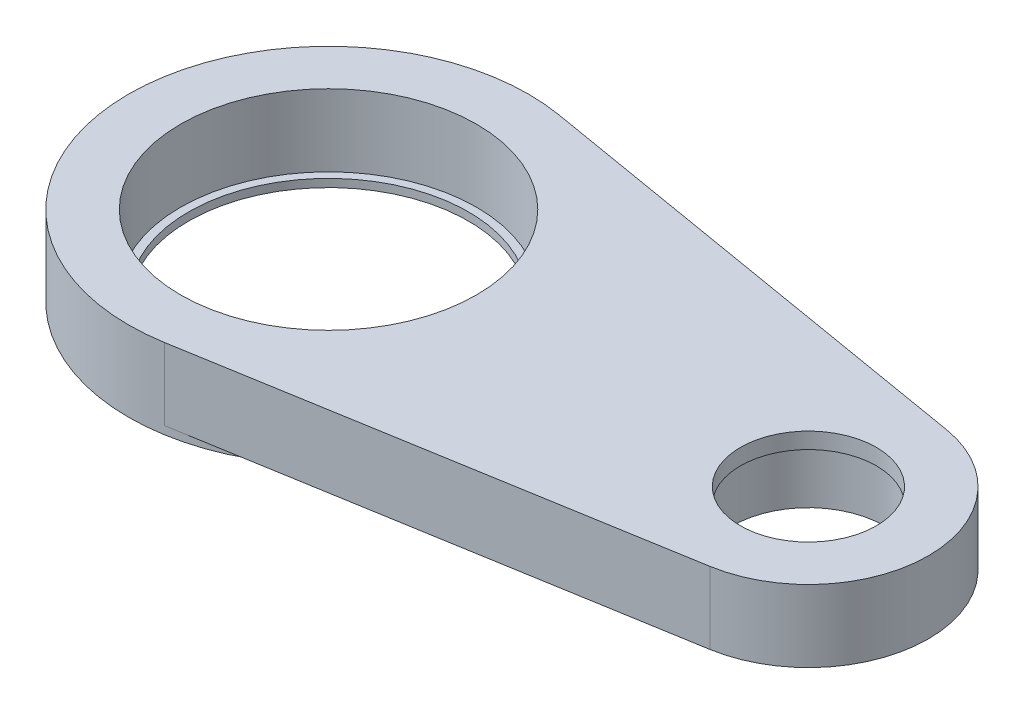
ISO-10303-21;
HEADER;
FILE_DESCRIPTION(('STEP AP214'),'2;1');
FILE_NAME('part.step','',(''),(''),'','','');
FILE_SCHEMA(('AUTOMOTIVE_DESIGN { 1 0 10303 214 1 1 1 1 }'));
ENDSEC;
DATA;
#1=APPLICATION_CONTEXT('core data for automotive mechanical design processes');
#2=APPLICATION_PROTOCOL_DEFINITION('international standard','automotive_design',2000,#1);
#3=PRODUCT_CONTEXT('',#1,'mechanical');
#4=PRODUCT('Part','Part','',(#3));
#5=PRODUCT_RELATED_PRODUCT_CATEGORY('part','',(#4));
#6=PRODUCT_DEFINITION_FORMATION('','',#4);
#7=PRODUCT_DEFINITION_CONTEXT('part definition',#1,'design');
#8=PRODUCT_DEFINITION('design','',#6,#7);
#9=PRODUCT_DEFINITION_SHAPE('','',#8);
#10=(LENGTH_UNIT() NAMED_UNIT(*) SI_UNIT(.MILLI.,.METRE.));
#11=(NAMED_UNIT(*) PLANE_ANGLE_UNIT() SI_UNIT($,.RADIAN.));
#12=(NAMED_UNIT(*) SI_UNIT($,.STERADIAN.) SOLID_ANGLE_UNIT());
#13=UNCERTAINTY_MEASURE_WITH_UNIT(LENGTH_MEASURE(1.E-05),#10,'distance_accuracy_value','');
#14=(GEOMETRIC_REPRESENTATION_CONTEXT(3) GLOBAL_UNCERTAINTY_ASSIGNED_CONTEXT((#13)) GLOBAL_UNIT_ASSIGNED_CONTEXT((#10,
#11,#12)) REPRESENTATION_CONTEXT('',''));
#15=CARTESIAN_POINT('',(0.,0.,0.));
#16=DIRECTION('',(0.,0.,1.));
#17=DIRECTION('',(1.,0.,0.));
#18=AXIS2_PLACEMENT_3D('',#15,#16,#17);
#19=CARTESIAN_POINT('',(0.,5.,0.));
#20=DIRECTION('',(0.,-1.,0.));
#21=DIRECTION('',(0.,0.,-1.));
#22=AXIS2_PLACEMENT_3D('',#19,#20,#21);
#23=CYLINDRICAL_SURFACE('',#22,17.5);
#24=CARTESIAN_POINT('',(0.,0.,0.));
#25=DIRECTION('',(0.,1.,0.));
#26=DIRECTION('',(0.,0.,1.));
#27=AXIS2_PLACEMENT_3D('',#24,#25,#26);
#28=CIRCLE('',#27,17.5);
#29=CARTESIAN_POINT('',(0.,0.,17.5));
#30=VERTEX_POINT('',#29);
#31=EDGE_CURVE('E48',#30,#30,#28,.T.);
#32=ORIENTED_EDGE('',*,*,#31,.F.);
#33=EDGE_LOOP('',(#32));
#34=FACE_BOUND('',#33,.T.);
#35=CARTESIAN_POINT('',(0.,1.,0.));
#36=DIRECTION('',(0.,1.,0.));
#37=DIRECTION('',(0.,0.,1.));
#38=AXIS2_PLACEMENT_3D('',#35,#36,#37);
#39=CIRCLE('',#38,17.5);
#40=CARTESIAN_POINT('',(0.,1.,17.5));
#41=VERTEX_POINT('',#40);
#42=EDGE_CURVE('E43',#41,#41,#39,.T.);
#43=ORIENTED_EDGE('',*,*,#42,.T.);
#44=EDGE_LOOP('',(#43));
#45=FACE_BOUND('',#44,.T.);
#46=ADVANCED_FACE('F39',(#34,#45),#23,.F.);
#47=CARTESIAN_POINT('',(0.,5.,0.));
#48=DIRECTION('',(0.,-1.,0.));
#49=DIRECTION('',(0.,0.,-1.));
#50=AXIS2_PLACEMENT_3D('',#47,#48,#49);
#51=CYLINDRICAL_SURFACE('',#50,25.);
#52=CARTESIAN_POINT('',(0.,0.,0.));
#53=DIRECTION('',(0.,1.,0.));
#54=DIRECTION('',(0.,0.,1.));
#55=AXIS2_PLACEMENT_3D('',#52,#53,#54);
#56=CIRCLE('',#55,25.);
#57=CARTESIAN_POINT('',(0.,0.,25.));
#58=VERTEX_POINT('',#57);
#59=EDGE_CURVE('E12',#58,#58,#56,.T.);
#60=ORIENTED_EDGE('',*,*,#59,.T.);
#61=EDGE_LOOP('',(#60));
#62=FACE_BOUND('',#61,.T.);
#63=DIRECTION('',(0.,1.,0.));
#64=VECTOR('',#63,1.);
#65=CARTESIAN_POINT('',(4.16666666666667,1.,24.6503324295817));
#66=LINE('',#65,#64);
#67=CARTESIAN_POINT('',(4.16666666666667,1.,24.6503324295817));
#68=VERTEX_POINT('',#67);
#69=CARTESIAN_POINT('',(4.16666666666667,10.,24.6503324295817));
#70=VERTEX_POINT('',#69);
#71=EDGE_CURVE('E104',#68,#70,#66,.T.);
#72=ORIENTED_EDGE('',*,*,#71,.T.);
#73=CARTESIAN_POINT('',(0.,10.,0.));
#74=DIRECTION('',(0.,1.,0.));
#75=DIRECTION('',(0.,0.,1.));
#76=AXIS2_PLACEMENT_3D('',#73,#74,#75);
#77=CIRCLE('',#76,25.);
#78=CARTESIAN_POINT('',(4.16666666666667,10.,-24.6503324295817));
#79=VERTEX_POINT('',#78);
#80=EDGE_CURVE('E103',#79,#70,#77,.T.);
#81=ORIENTED_EDGE('',*,*,#80,.F.);
#82=DIRECTION('',(0.,1.,0.));
#83=VECTOR('',#82,1.);
#84=CARTESIAN_POINT('',(4.16666666666667,1.,-24.6503324295817));
#85=LINE('',#84,#83);
#86=CARTESIAN_POINT('',(4.16666666666667,1.,-24.6503324295817));
#87=VERTEX_POINT('',#86);
#88=EDGE_CURVE('E99',#87,#79,#85,.T.);
#89=ORIENTED_EDGE('',*,*,#88,.F.);
#90=CARTESIAN_POINT('',(0.,1.,0.));
#91=DIRECTION('',(0.,-1.,0.));
#92=DIRECTION('',(0.,0.,1.));
#93=AXIS2_PLACEMENT_3D('',#90,#91,#92);
#94=CIRCLE('',#93,25.);
#95=EDGE_CURVE('E90',#87,#68,#94,.T.);
#96=ORIENTED_EDGE('',*,*,#95,.T.);
#97=EDGE_LOOP('',(#72,#81,#89,#96));
#98=FACE_BOUND('',#97,.T.);
#99=ADVANCED_FACE('F41',(#62,#98),#51,.T.);
#100=CARTESIAN_POINT('',(0.,0.,0.));
#101=DIRECTION('',(0.,1.,0.));
#102=DIRECTION('',(0.,0.,1.));
#103=AXIS2_PLACEMENT_3D('',#100,#101,#102);
#104=PLANE('',#103);
#105=ORIENTED_EDGE('',*,*,#59,.F.);
#106=EDGE_LOOP('',(#105));
#107=FACE_BOUND('',#106,.T.);
#108=ORIENTED_EDGE('',*,*,#31,.T.);
#109=EDGE_LOOP('',(#108));
#110=FACE_BOUND('',#109,.T.);
#111=ADVANCED_FACE('F117',(#107,#110),#104,.F.);
#112=CARTESIAN_POINT('',(0.,10.,0.));
#113=DIRECTION('',(0.,1.,0.));
#114=DIRECTION('',(0.,0.,1.));
#115=AXIS2_PLACEMENT_3D('',#112,#113,#114);
#116=PLANE('',#115);
#117=CARTESIAN_POINT('',(60.,10.,0.));
#118=DIRECTION('',(0.,-1.,0.));
#119=DIRECTION('',(0.,0.,-1.));
#120=AXIS2_PLACEMENT_3D('',#117,#118,#119);
#121=CIRCLE('',#120,8.50000000000001);
#122=CARTESIAN_POINT('',(60.,10.,-8.50000000000001));
#123=VERTEX_POINT('',#122);
#124=EDGE_CURVE('E249',#123,#123,#121,.T.);
#125=ORIENTED_EDGE('',*,*,#124,.T.);
#126=EDGE_LOOP('',(#125));
#127=FACE_BOUND('',#126,.T.);
#128=ORIENTED_EDGE('',*,*,#80,.T.);
#129=DIRECTION('',(0.986013297183269,0.,-0.166666666666667));
#130=VECTOR('',#129,1.);
#131=CARTESIAN_POINT('',(4.16666666666667,10.,24.6503324295817));
#132=LINE('',#131,#130);
#133=CARTESIAN_POINT('',(62.5,10.,14.790199457749));
#134=VERTEX_POINT('',#133);
#135=EDGE_CURVE('E138',#70,#134,#132,.T.);
#136=ORIENTED_EDGE('',*,*,#135,.T.);
#137=CARTESIAN_POINT('',(60.,10.,0.));
#138=DIRECTION('',(0.,1.,0.));
#139=DIRECTION('',(0.,0.,1.));
#140=AXIS2_PLACEMENT_3D('',#137,#138,#139);
#141=CIRCLE('',#140,15.);
#142=CARTESIAN_POINT('',(62.5,10.,-14.790199457749));
#143=VERTEX_POINT('',#142);
#144=EDGE_CURVE('E125',#134,#143,#141,.T.);
#145=ORIENTED_EDGE('',*,*,#144,.T.);
#146=DIRECTION('',(-0.986013297183269,0.,-0.166666666666667));
#147=VECTOR('',#146,1.);
#148=CARTESIAN_POINT('',(4.16666666666667,10.,-24.6503324295817));
#149=LINE('',#148,#147);
#150=EDGE_CURVE('E55',#143,#79,#149,.T.);
#151=ORIENTED_EDGE('',*,*,#150,.T.);
#152=EDGE_LOOP('',(#128,#136,#145,#151));
#153=FACE_BOUND('',#152,.T.);
#154=CARTESIAN_POINT('',(0.,10.,0.));
#155=DIRECTION('',(0.,1.,0.));
#156=DIRECTION('',(0.,0.,1.));
#157=AXIS2_PLACEMENT_3D('',#154,#155,#156);
#158=CIRCLE('',#157,18.5);
#159=CARTESIAN_POINT('',(0.,10.,18.5));
#160=VERTEX_POINT('',#159);
#161=EDGE_CURVE('E110',#160,#160,#158,.T.);
#162=ORIENTED_EDGE('',*,*,#161,.F.);
#163=EDGE_LOOP('',(#162));
#164=FACE_BOUND('',#163,.T.);
#165=ADVANCED_FACE('F143',(#127,#153,#164),#116,.T.);
#166=CARTESIAN_POINT('',(0.,10.,0.));
#167=DIRECTION('',(0.,-1.,0.));
#168=DIRECTION('',(0.,0.,-1.));
#169=AXIS2_PLACEMENT_3D('',#166,#167,#168);
#170=CYLINDRICAL_SURFACE('',#169,18.5);
#171=ORIENTED_EDGE('',*,*,#161,.T.);
#172=EDGE_LOOP('',(#171));
#173=FACE_BOUND('',#172,.T.);
#174=CARTESIAN_POINT('',(0.,1.,0.));
#175=DIRECTION('',(0.,1.,0.));
#176=DIRECTION('',(0.,0.,1.));
#177=AXIS2_PLACEMENT_3D('',#174,#175,#176);
#178=CIRCLE('',#177,18.5);
#179=CARTESIAN_POINT('',(0.,1.,18.5));
#180=VERTEX_POINT('',#179);
#181=EDGE_CURVE('E126',#180,#180,#178,.T.);
#182=ORIENTED_EDGE('',*,*,#181,.F.);
#183=EDGE_LOOP('',(#182));
#184=FACE_BOUND('',#183,.T.);
#185=ADVANCED_FACE('F154',(#173,#184),#170,.F.);
#186=CARTESIAN_POINT('',(60.,1.,0.));
#187=DIRECTION('',(0.,1.,0.));
#188=DIRECTION('',(0.,0.,1.));
#189=AXIS2_PLACEMENT_3D('',#186,#187,#188);
#190=CYLINDRICAL_SURFACE('',#189,15.);
#191=ORIENTED_EDGE('',*,*,#144,.F.);
#192=DIRECTION('',(0.,1.,0.));
#193=VECTOR('',#192,1.);
#194=CARTESIAN_POINT('',(62.5,1.,14.790199457749));
#195=LINE('',#194,#193);
#196=CARTESIAN_POINT('',(62.5,1.,14.790199457749));
#197=VERTEX_POINT('',#196);
#198=EDGE_CURVE('E64',#197,#134,#195,.T.);
#199=ORIENTED_EDGE('',*,*,#198,.F.);
#200=CARTESIAN_POINT('',(60.,1.,0.));
#201=DIRECTION('',(0.,1.,0.));
#202=DIRECTION('',(0.,0.,1.));
#203=AXIS2_PLACEMENT_3D('',#200,#201,#202);
#204=CIRCLE('',#203,15.);
#205=CARTESIAN_POINT('',(62.5,1.,-14.790199457749));
#206=VERTEX_POINT('',#205);
#207=EDGE_CURVE('E101',#197,#206,#204,.T.);
#208=ORIENTED_EDGE('',*,*,#207,.T.);
#209=DIRECTION('',(0.,1.,0.));
#210=VECTOR('',#209,1.);
#211=CARTESIAN_POINT('',(62.5,1.,-14.790199457749));
#212=LINE('',#211,#210);
#213=EDGE_CURVE('E84',#206,#143,#212,.T.);
#214=ORIENTED_EDGE('',*,*,#213,.T.);
#215=EDGE_LOOP('',(#191,#199,#208,#214));
#216=FACE_BOUND('',#215,.T.);
#217=ADVANCED_FACE('F147',(#216),#190,.T.);
#218=CARTESIAN_POINT('',(4.16666666666667,1.,24.6503324295817));
#219=DIRECTION('',(0.166666666666667,0.,0.986013297183269));
#220=DIRECTION('',(0.986013297183269,0.,-0.166666666666667));
#221=AXIS2_PLACEMENT_3D('',#218,#219,#220);
#222=PLANE('',#221);
#223=ORIENTED_EDGE('',*,*,#135,.F.);
#224=ORIENTED_EDGE('',*,*,#71,.F.);
#225=DIRECTION('',(0.986013297183269,0.,-0.166666666666667));
#226=VECTOR('',#225,1.);
#227=CARTESIAN_POINT('',(4.16666666666667,1.,24.6503324295817));
#228=LINE('',#227,#226);
#229=EDGE_CURVE('E93',#68,#197,#228,.T.);
#230=ORIENTED_EDGE('',*,*,#229,.T.);
#231=ORIENTED_EDGE('',*,*,#198,.T.);
#232=EDGE_LOOP('',(#223,#224,#230,#231));
#233=FACE_BOUND('',#232,.T.);
#234=ADVANCED_FACE('F145',(#233),#222,.T.);
#235=CARTESIAN_POINT('',(4.16666666666667,1.,-24.6503324295817));
#236=DIRECTION('',(0.166666666666667,0.,-0.986013297183269));
#237=DIRECTION('',(-0.986013297183269,0.,-0.166666666666667));
#238=AXIS2_PLACEMENT_3D('',#235,#236,#237);
#239=PLANE('',#238);
#240=ORIENTED_EDGE('',*,*,#150,.F.);
#241=ORIENTED_EDGE('',*,*,#213,.F.);
#242=DIRECTION('',(-0.986013297183269,0.,-0.166666666666667));
#243=VECTOR('',#242,1.);
#244=CARTESIAN_POINT('',(4.16666666666667,1.,-24.6503324295817));
#245=LINE('',#244,#243);
#246=EDGE_CURVE('E92',#206,#87,#245,.T.);
#247=ORIENTED_EDGE('',*,*,#246,.T.);
#248=ORIENTED_EDGE('',*,*,#88,.T.);
#249=EDGE_LOOP('',(#240,#241,#247,#248));
#250=FACE_BOUND('',#249,.T.);
#251=ADVANCED_FACE('F98',(#250),#239,.T.);
#252=CARTESIAN_POINT('',(60.,1.,0.));
#253=DIRECTION('',(0.,1.,0.));
#254=DIRECTION('',(0.,0.,1.));
#255=AXIS2_PLACEMENT_3D('',#252,#253,#254);
#256=PLANE('',#255);
#257=CARTESIAN_POINT('',(60.,1.,0.));
#258=DIRECTION('',(0.,-1.,0.));
#259=DIRECTION('',(0.,0.,-1.));
#260=AXIS2_PLACEMENT_3D('',#257,#258,#259);
#261=CIRCLE('',#260,9.50000000000001);
#262=CARTESIAN_POINT('',(60.,1.,-9.50000000000001));
#263=VERTEX_POINT('',#262);
#264=EDGE_CURVE('E134',#263,#263,#261,.T.);
#265=ORIENTED_EDGE('',*,*,#264,.F.);
#266=EDGE_LOOP('',(#265));
#267=FACE_BOUND('',#266,.T.);
#268=ORIENTED_EDGE('',*,*,#207,.F.);
#269=ORIENTED_EDGE('',*,*,#229,.F.);
#270=ORIENTED_EDGE('',*,*,#95,.F.);
#271=ORIENTED_EDGE('',*,*,#246,.F.);
#272=EDGE_LOOP('',(#268,#269,#270,#271));
#273=FACE_BOUND('',#272,.T.);
#274=ADVANCED_FACE('F91',(#267,#273),#256,.F.);
#275=CARTESIAN_POINT('',(0.,1.,0.));
#276=DIRECTION('',(0.,1.,0.));
#277=DIRECTION('',(0.,0.,1.));
#278=AXIS2_PLACEMENT_3D('',#275,#276,#277);
#279=PLANE('',#278);
#280=ORIENTED_EDGE('',*,*,#42,.F.);
#281=EDGE_LOOP('',(#280));
#282=FACE_BOUND('',#281,.T.);
#283=ORIENTED_EDGE('',*,*,#181,.T.);
#284=EDGE_LOOP('',(#283));
#285=FACE_BOUND('',#284,.T.);
#286=ADVANCED_FACE('F195',(#282,#285),#279,.T.);
#287=CARTESIAN_POINT('',(60.,8.,0.));
#288=DIRECTION('',(0.,-1.,0.));
#289=DIRECTION('',(0.,0.,-1.));
#290=AXIS2_PLACEMENT_3D('',#287,#288,#289);
#291=CYLINDRICAL_SURFACE('',#290,9.50000000000001);
#292=CARTESIAN_POINT('',(60.,8.,0.));
#293=DIRECTION('',(0.,-1.,0.));
#294=DIRECTION('',(0.,0.,-1.));
#295=AXIS2_PLACEMENT_3D('',#292,#293,#294);
#296=CIRCLE('',#295,9.50000000000001);
#297=CARTESIAN_POINT('',(60.,8.,-9.50000000000001));
#298=VERTEX_POINT('',#297);
#299=EDGE_CURVE('E129',#298,#298,#296,.T.);
#300=ORIENTED_EDGE('',*,*,#299,.F.);
#301=EDGE_LOOP('',(#300));
#302=FACE_BOUND('',#301,.T.);
#303=ORIENTED_EDGE('',*,*,#264,.T.);
#304=EDGE_LOOP('',(#303));
#305=FACE_BOUND('',#304,.T.);
#306=ADVANCED_FACE('F199',(#302,#305),#291,.F.);
#307=CARTESIAN_POINT('',(60.,8.,0.));
#308=DIRECTION('',(0.,-1.,0.));
#309=DIRECTION('',(0.,0.,-1.));
#310=AXIS2_PLACEMENT_3D('',#307,#308,#309);
#311=PLANE('',#310);
#312=CARTESIAN_POINT('',(60.,8.,0.));
#313=DIRECTION('',(0.,-1.,0.));
#314=DIRECTION('',(0.,0.,-1.));
#315=AXIS2_PLACEMENT_3D('',#312,#313,#314);
#316=CIRCLE('',#315,8.50000000000001);
#317=CARTESIAN_POINT('',(60.,8.,-8.50000000000001));
#318=VERTEX_POINT('',#317);
#319=EDGE_CURVE('E252',#318,#318,#316,.T.);
#320=ORIENTED_EDGE('',*,*,#319,.F.);
#321=EDGE_LOOP('',(#320));
#322=FACE_BOUND('',#321,.T.);
#323=ORIENTED_EDGE('',*,*,#299,.T.);
#324=EDGE_LOOP('',(#323));
#325=FACE_BOUND('',#324,.T.);
#326=ADVANCED_FACE('F214',(#322,#325),#311,.T.);
#327=CARTESIAN_POINT('',(60.,10.,0.));
#328=DIRECTION('',(0.,-1.,0.));
#329=DIRECTION('',(0.,0.,-1.));
#330=AXIS2_PLACEMENT_3D('',#327,#328,#329);
#331=CYLINDRICAL_SURFACE('',#330,8.50000000000001);
#332=ORIENTED_EDGE('',*,*,#124,.F.);
#333=EDGE_LOOP('',(#332));
#334=FACE_BOUND('',#333,.T.);
#335=ORIENTED_EDGE('',*,*,#319,.T.);
#336=EDGE_LOOP('',(#335));
#337=FACE_BOUND('',#336,.T.);
#338=ADVANCED_FACE('F232',(#334,#337),#331,.F.);
#339=CLOSED_SHELL('',(#46,#99,#111,#165,#185,#217,#234,#251,#274,#286,#306,#326,#338));
#340=MANIFOLD_SOLID_BREP('B2',#339);
#341=ADVANCED_BREP_SHAPE_REPRESENTATION('',(#18,#340),#14);
#342=SHAPE_DEFINITION_REPRESENTATION(#9,#341);
ENDSEC;
END-ISO-10303-21;
